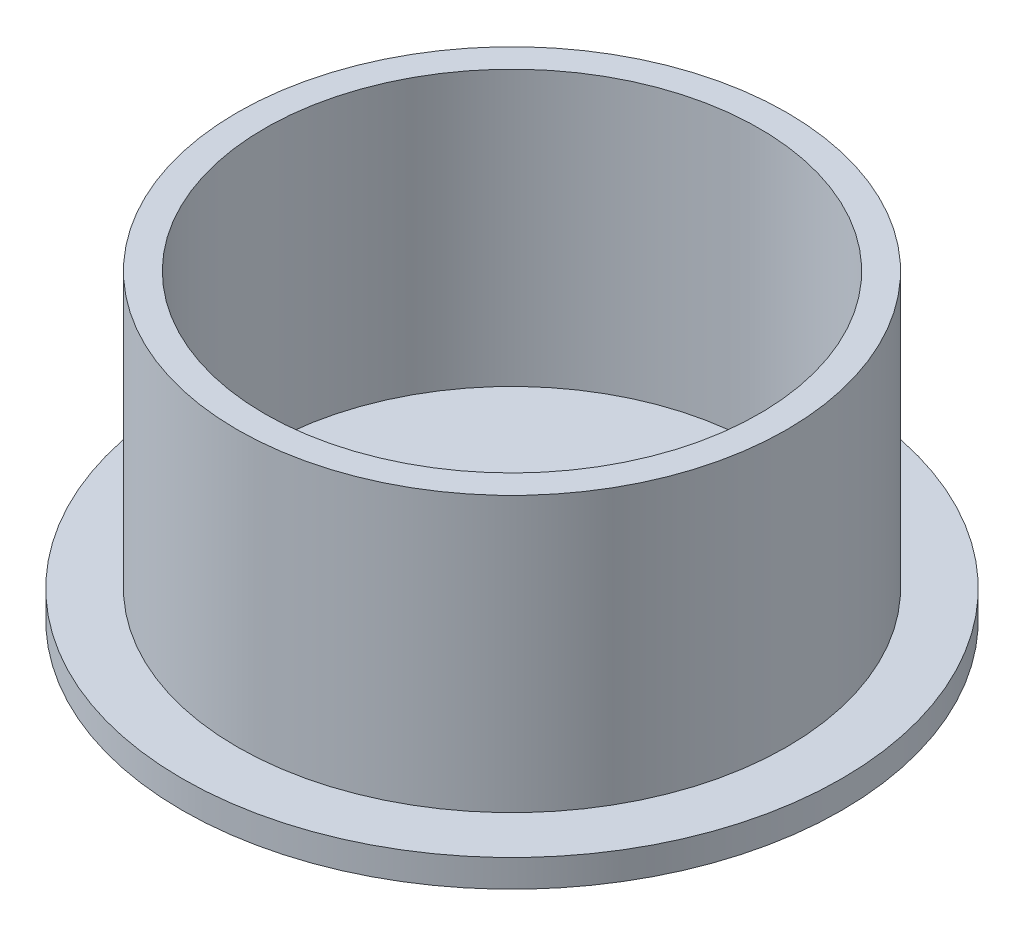
ISO-10303-21;
HEADER;
FILE_DESCRIPTION(('STEP AP214'),'2;1');
FILE_NAME('part.step','',(''),(''),'','','');
FILE_SCHEMA(('AUTOMOTIVE_DESIGN { 1 0 10303 214 1 1 1 1 }'));
ENDSEC;
DATA;
#1=APPLICATION_CONTEXT('core data for automotive mechanical design processes');
#2=APPLICATION_PROTOCOL_DEFINITION('international standard','automotive_design',2000,#1);
#3=PRODUCT_CONTEXT('',#1,'mechanical');
#4=PRODUCT('Part','Part','',(#3));
#5=PRODUCT_RELATED_PRODUCT_CATEGORY('part','',(#4));
#6=PRODUCT_DEFINITION_FORMATION('','',#4);
#7=PRODUCT_DEFINITION_CONTEXT('part definition',#1,'design');
#8=PRODUCT_DEFINITION('design','',#6,#7);
#9=PRODUCT_DEFINITION_SHAPE('','',#8);
#10=(LENGTH_UNIT() NAMED_UNIT(*) SI_UNIT(.MILLI.,.METRE.));
#11=(NAMED_UNIT(*) PLANE_ANGLE_UNIT() SI_UNIT($,.RADIAN.));
#12=(NAMED_UNIT(*) SI_UNIT($,.STERADIAN.) SOLID_ANGLE_UNIT());
#13=UNCERTAINTY_MEASURE_WITH_UNIT(LENGTH_MEASURE(1.E-05),#10,'distance_accuracy_value','');
#14=(GEOMETRIC_REPRESENTATION_CONTEXT(3) GLOBAL_UNCERTAINTY_ASSIGNED_CONTEXT((#13)) GLOBAL_UNIT_ASSIGNED_CONTEXT((#10,
#11,#12)) REPRESENTATION_CONTEXT('',''));
#15=CARTESIAN_POINT('',(0.,0.,0.));
#16=DIRECTION('',(0.,0.,1.));
#17=DIRECTION('',(1.,0.,0.));
#18=AXIS2_PLACEMENT_3D('',#15,#16,#17);
#19=CARTESIAN_POINT('',(0.,5.,0.));
#20=DIRECTION('',(0.,-1.,0.));
#21=DIRECTION('',(0.,0.,-1.));
#22=AXIS2_PLACEMENT_3D('',#19,#20,#21);
#23=CYLINDRICAL_SURFACE('',#22,60.);
#24=CARTESIAN_POINT('',(0.,5.,0.));
#25=DIRECTION('',(0.,1.,0.));
#26=DIRECTION('',(0.,0.,1.));
#27=AXIS2_PLACEMENT_3D('',#24,#25,#26);
#28=CIRCLE('',#27,60.);
#29=CARTESIAN_POINT('',(0.,5.,60.));
#30=VERTEX_POINT('',#29);
#31=EDGE_CURVE('E50',#30,#30,#28,.T.);
#32=ORIENTED_EDGE('',*,*,#31,.F.);
#33=EDGE_LOOP('',(#32));
#34=FACE_BOUND('',#33,.T.);
#35=CARTESIAN_POINT('',(0.,0.,0.));
#36=DIRECTION('',(0.,1.,0.));
#37=DIRECTION('',(0.,0.,1.));
#38=AXIS2_PLACEMENT_3D('',#35,#36,#37);
#39=CIRCLE('',#38,60.);
#40=CARTESIAN_POINT('',(0.,0.,60.));
#41=VERTEX_POINT('',#40);
#42=EDGE_CURVE('E55',#41,#41,#39,.T.);
#43=ORIENTED_EDGE('',*,*,#42,.T.);
#44=EDGE_LOOP('',(#43));
#45=FACE_BOUND('',#44,.T.);
#46=ADVANCED_FACE('F43',(#34,#45),#23,.T.);
#47=CARTESIAN_POINT('',(0.,5.,0.));
#48=DIRECTION('',(0.,1.,0.));
#49=DIRECTION('',(0.,0.,1.));
#50=AXIS2_PLACEMENT_3D('',#47,#48,#49);
#51=PLANE('',#50);
#52=CARTESIAN_POINT('',(0.,5.,0.));
#53=DIRECTION('',(0.,1.,0.));
#54=DIRECTION('',(0.,0.,1.));
#55=AXIS2_PLACEMENT_3D('',#52,#53,#54);
#56=CIRCLE('',#55,50.);
#57=CARTESIAN_POINT('',(0.,5.,50.));
#58=VERTEX_POINT('',#57);
#59=EDGE_CURVE('E63',#58,#58,#56,.T.);
#60=ORIENTED_EDGE('',*,*,#59,.F.);
#61=EDGE_LOOP('',(#60));
#62=FACE_BOUND('',#61,.T.);
#63=ORIENTED_EDGE('',*,*,#31,.T.);
#64=EDGE_LOOP('',(#63));
#65=FACE_BOUND('',#64,.T.);
#66=ADVANCED_FACE('F90',(#62,#65),#51,.T.);
#67=CARTESIAN_POINT('',(0.,0.,0.));
#68=DIRECTION('',(0.,1.,0.));
#69=DIRECTION('',(0.,0.,1.));
#70=AXIS2_PLACEMENT_3D('',#67,#68,#69);
#71=PLANE('',#70);
#72=ORIENTED_EDGE('',*,*,#42,.F.);
#73=EDGE_LOOP('',(#72));
#74=FACE_BOUND('',#73,.T.);
#75=ADVANCED_FACE('F80',(#74),#71,.F.);
#76=CARTESIAN_POINT('',(0.,55.,0.));
#77=DIRECTION('',(0.,1.,0.));
#78=DIRECTION('',(0.,0.,1.));
#79=AXIS2_PLACEMENT_3D('',#76,#77,#78);
#80=PLANE('',#79);
#81=CARTESIAN_POINT('',(0.,55.,0.));
#82=DIRECTION('',(0.,1.,0.));
#83=DIRECTION('',(0.,0.,1.));
#84=AXIS2_PLACEMENT_3D('',#81,#82,#83);
#85=CIRCLE('',#84,50.);
#86=CARTESIAN_POINT('',(0.,55.,50.));
#87=VERTEX_POINT('',#86);
#88=EDGE_CURVE('E61',#87,#87,#85,.T.);
#89=ORIENTED_EDGE('',*,*,#88,.T.);
#90=EDGE_LOOP('',(#89));
#91=FACE_BOUND('',#90,.T.);
#92=CARTESIAN_POINT('',(0.,55.,0.));
#93=DIRECTION('',(0.,1.,0.));
#94=DIRECTION('',(0.,0.,1.));
#95=AXIS2_PLACEMENT_3D('',#92,#93,#94);
#96=CIRCLE('',#95,45.);
#97=CARTESIAN_POINT('',(0.,55.,45.));
#98=VERTEX_POINT('',#97);
#99=EDGE_CURVE('E67',#98,#98,#96,.T.);
#100=ORIENTED_EDGE('',*,*,#99,.F.);
#101=EDGE_LOOP('',(#100));
#102=FACE_BOUND('',#101,.T.);
#103=ADVANCED_FACE('F77',(#91,#102),#80,.T.);
#104=CARTESIAN_POINT('',(0.,55.,0.));
#105=DIRECTION('',(0.,-1.,0.));
#106=DIRECTION('',(0.,0.,-1.));
#107=AXIS2_PLACEMENT_3D('',#104,#105,#106);
#108=CYLINDRICAL_SURFACE('',#107,50.);
#109=ORIENTED_EDGE('',*,*,#88,.F.);
#110=EDGE_LOOP('',(#109));
#111=FACE_BOUND('',#110,.T.);
#112=ORIENTED_EDGE('',*,*,#59,.T.);
#113=EDGE_LOOP('',(#112));
#114=FACE_BOUND('',#113,.T.);
#115=ADVANCED_FACE('F79',(#111,#114),#108,.T.);
#116=CARTESIAN_POINT('',(0.,55.,0.));
#117=DIRECTION('',(0.,-1.,0.));
#118=DIRECTION('',(0.,0.,-1.));
#119=AXIS2_PLACEMENT_3D('',#116,#117,#118);
#120=CYLINDRICAL_SURFACE('',#119,45.);
#121=ORIENTED_EDGE('',*,*,#99,.T.);
#122=EDGE_LOOP('',(#121));
#123=FACE_BOUND('',#122,.T.);
#124=CARTESIAN_POINT('',(0.,5.,0.));
#125=DIRECTION('',(0.,1.,0.));
#126=DIRECTION('',(0.,0.,1.));
#127=AXIS2_PLACEMENT_3D('',#124,#125,#126);
#128=CIRCLE('',#127,45.);
#129=CARTESIAN_POINT('',(0.,5.,45.));
#130=VERTEX_POINT('',#129);
#131=EDGE_CURVE('E10',#130,#130,#128,.F.);
#132=ORIENTED_EDGE('',*,*,#131,.T.);
#133=EDGE_LOOP('',(#132));
#134=FACE_BOUND('',#133,.T.);
#135=ADVANCED_FACE('F75',(#123,#134),#120,.F.);
#136=ORIENTED_EDGE('',*,*,#131,.F.);
#137=EDGE_LOOP('',(#136));
#138=FACE_BOUND('',#137,.T.);
#139=ADVANCED_FACE('F99',(#138),#51,.T.);
#140=CLOSED_SHELL('',(#46,#66,#75,#103,#115,#135,#139));
#141=MANIFOLD_SOLID_BREP('B2',#140);
#142=ADVANCED_BREP_SHAPE_REPRESENTATION('',(#18,#141),#14);
#143=SHAPE_DEFINITION_REPRESENTATION(#9,#142);
ENDSEC;
END-ISO-10303-21;
